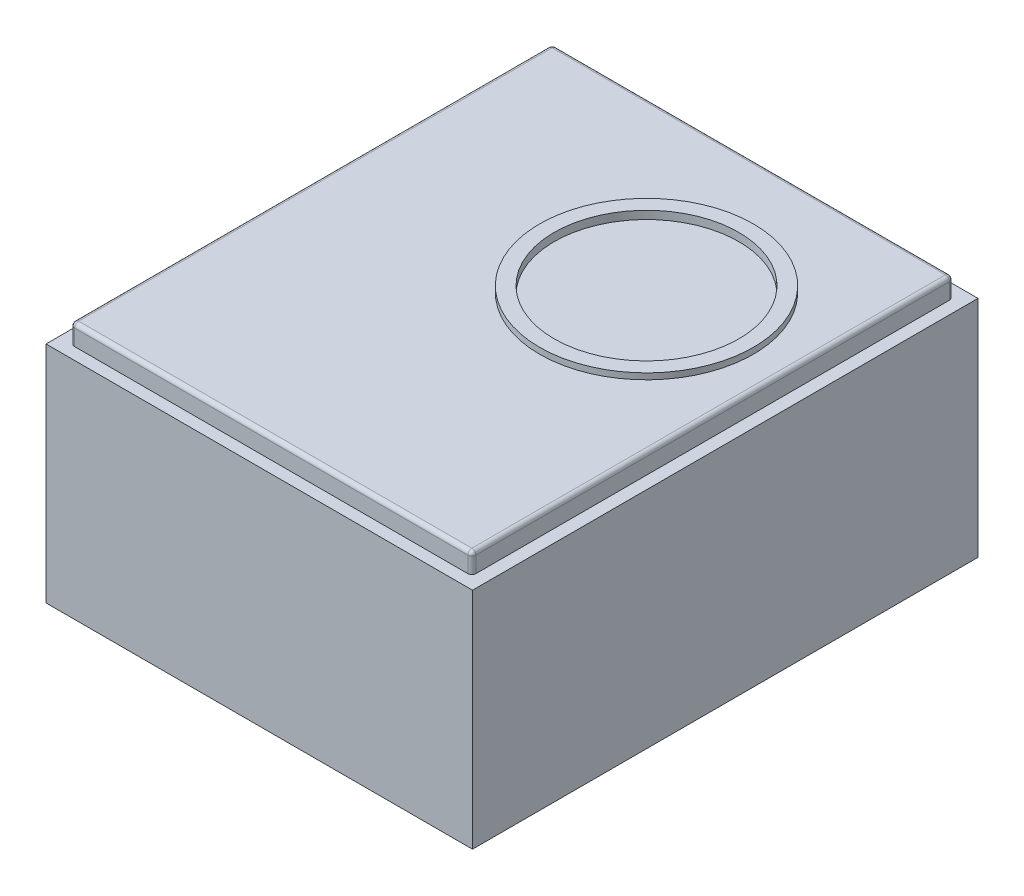
ISO-10303-21;
HEADER;
FILE_DESCRIPTION(('STEP AP214'),'2;1');
FILE_NAME('part.step','',(''),(''),'','','');
FILE_SCHEMA(('AUTOMOTIVE_DESIGN { 1 0 10303 214 1 1 1 1 }'));
ENDSEC;
DATA;
#1=APPLICATION_CONTEXT('core data for automotive mechanical design processes');
#2=APPLICATION_PROTOCOL_DEFINITION('international standard','automotive_design',2000,#1);
#3=PRODUCT_CONTEXT('',#1,'mechanical');
#4=PRODUCT('Part','Part','',(#3));
#5=PRODUCT_RELATED_PRODUCT_CATEGORY('part','',(#4));
#6=PRODUCT_DEFINITION_FORMATION('','',#4);
#7=PRODUCT_DEFINITION_CONTEXT('part definition',#1,'design');
#8=PRODUCT_DEFINITION('design','',#6,#7);
#9=PRODUCT_DEFINITION_SHAPE('','',#8);
#10=(LENGTH_UNIT() NAMED_UNIT(*) SI_UNIT(.MILLI.,.METRE.));
#11=(NAMED_UNIT(*) PLANE_ANGLE_UNIT() SI_UNIT($,.RADIAN.));
#12=(NAMED_UNIT(*) SI_UNIT($,.STERADIAN.) SOLID_ANGLE_UNIT());
#13=UNCERTAINTY_MEASURE_WITH_UNIT(LENGTH_MEASURE(1.E-05),#10,'distance_accuracy_value','');
#14=(GEOMETRIC_REPRESENTATION_CONTEXT(3) GLOBAL_UNCERTAINTY_ASSIGNED_CONTEXT((#13)) GLOBAL_UNIT_ASSIGNED_CONTEXT((#10,
#11,#12)) REPRESENTATION_CONTEXT('',''));
#15=CARTESIAN_POINT('',(0.,0.,0.));
#16=DIRECTION('',(0.,0.,1.));
#17=DIRECTION('',(1.,0.,0.));
#18=AXIS2_PLACEMENT_3D('',#15,#16,#17);
#19=CARTESIAN_POINT('',(0.,142.,0.));
#20=DIRECTION('',(0.,-1.,0.));
#21=DIRECTION('',(0.,0.,-1.));
#22=AXIS2_PLACEMENT_3D('',#19,#20,#21);
#23=PLANE('',#22);
#24=DIRECTION('',(0.,0.,-1.));
#25=VECTOR('',#24,1.);
#26=CARTESIAN_POINT('',(135.,142.,160.));
#27=LINE('',#26,#25);
#28=CARTESIAN_POINT('',(135.,142.,160.));
#29=VERTEX_POINT('',#28);
#30=CARTESIAN_POINT('',(135.,142.,-160.));
#31=VERTEX_POINT('',#30);
#32=EDGE_CURVE('E161',#29,#31,#27,.T.);
#33=ORIENTED_EDGE('',*,*,#32,.T.);
#34=DIRECTION('',(-1.,0.,0.));
#35=VECTOR('',#34,1.);
#36=CARTESIAN_POINT('',(-135.,142.,-160.));
#37=LINE('',#36,#35);
#38=CARTESIAN_POINT('',(-135.,142.,-160.));
#39=VERTEX_POINT('',#38);
#40=EDGE_CURVE('E149',#31,#39,#37,.T.);
#41=ORIENTED_EDGE('',*,*,#40,.T.);
#42=DIRECTION('',(0.,0.,1.));
#43=VECTOR('',#42,1.);
#44=CARTESIAN_POINT('',(-135.,142.,160.));
#45=LINE('',#44,#43);
#46=CARTESIAN_POINT('',(-135.,142.,160.));
#47=VERTEX_POINT('',#46);
#48=EDGE_CURVE('E160',#39,#47,#45,.T.);
#49=ORIENTED_EDGE('',*,*,#48,.T.);
#50=DIRECTION('',(1.,0.,0.));
#51=VECTOR('',#50,1.);
#52=CARTESIAN_POINT('',(-135.,142.,160.));
#53=LINE('',#52,#51);
#54=EDGE_CURVE('E166',#47,#29,#53,.T.);
#55=ORIENTED_EDGE('',*,*,#54,.T.);
#56=EDGE_LOOP('',(#33,#41,#49,#55));
#57=FACE_BOUND('',#56,.T.);
#58=DIRECTION('',(0.,0.,-1.));
#59=VECTOR('',#58,1.);
#60=CARTESIAN_POINT('',(127.,142.,-152.4));
#61=LINE('',#60,#59);
#62=CARTESIAN_POINT('',(127.,142.,149.86));
#63=VERTEX_POINT('',#62);
#64=CARTESIAN_POINT('',(127.,142.,-149.86));
#65=VERTEX_POINT('',#64);
#66=EDGE_CURVE('E285',#63,#65,#61,.T.);
#67=ORIENTED_EDGE('',*,*,#66,.F.);
#68=CARTESIAN_POINT('',(124.46,142.,149.86));
#69=DIRECTION('',(0.,-1.,0.));
#70=DIRECTION('',(0.,0.,-1.));
#71=AXIS2_PLACEMENT_3D('',#68,#69,#70);
#72=CIRCLE('',#71,2.54);
#73=CARTESIAN_POINT('',(124.46,142.,152.4));
#74=VERTEX_POINT('',#73);
#75=EDGE_CURVE('E218',#63,#74,#72,.T.);
#76=ORIENTED_EDGE('',*,*,#75,.T.);
#77=DIRECTION('',(1.,0.,0.));
#78=VECTOR('',#77,1.);
#79=CARTESIAN_POINT('',(-127.,142.,152.4));
#80=LINE('',#79,#78);
#81=CARTESIAN_POINT('',(-124.46,142.,152.4));
#82=VERTEX_POINT('',#81);
#83=EDGE_CURVE('E306',#82,#74,#80,.T.);
#84=ORIENTED_EDGE('',*,*,#83,.F.);
#85=CARTESIAN_POINT('',(-124.46,142.,149.86));
#86=DIRECTION('',(0.,-1.,0.));
#87=DIRECTION('',(0.,0.,-1.));
#88=AXIS2_PLACEMENT_3D('',#85,#86,#87);
#89=CIRCLE('',#88,2.54);
#90=CARTESIAN_POINT('',(-127.,142.,149.86));
#91=VERTEX_POINT('',#90);
#92=EDGE_CURVE('E215',#82,#91,#89,.T.);
#93=ORIENTED_EDGE('',*,*,#92,.T.);
#94=DIRECTION('',(0.,0.,1.));
#95=VECTOR('',#94,1.);
#96=CARTESIAN_POINT('',(-127.,142.,-152.4));
#97=LINE('',#96,#95);
#98=CARTESIAN_POINT('',(-127.,142.,-149.86));
#99=VERTEX_POINT('',#98);
#100=EDGE_CURVE('E297',#99,#91,#97,.T.);
#101=ORIENTED_EDGE('',*,*,#100,.F.);
#102=CARTESIAN_POINT('',(-124.46,142.,-149.86));
#103=DIRECTION('',(0.,-1.,0.));
#104=DIRECTION('',(0.,0.,-1.));
#105=AXIS2_PLACEMENT_3D('',#102,#103,#104);
#106=CIRCLE('',#105,2.54);
#107=CARTESIAN_POINT('',(-124.46,142.,-152.4));
#108=VERTEX_POINT('',#107);
#109=EDGE_CURVE('E212',#99,#108,#106,.T.);
#110=ORIENTED_EDGE('',*,*,#109,.T.);
#111=DIRECTION('',(-1.,0.,0.));
#112=VECTOR('',#111,1.);
#113=CARTESIAN_POINT('',(-127.,142.,-152.4));
#114=LINE('',#113,#112);
#115=CARTESIAN_POINT('',(124.46,142.,-152.4));
#116=VERTEX_POINT('',#115);
#117=EDGE_CURVE('E291',#116,#108,#114,.T.);
#118=ORIENTED_EDGE('',*,*,#117,.F.);
#119=CARTESIAN_POINT('',(124.46,142.,-149.86));
#120=DIRECTION('',(0.,-1.,0.));
#121=DIRECTION('',(0.,0.,-1.));
#122=AXIS2_PLACEMENT_3D('',#119,#120,#121);
#123=CIRCLE('',#122,2.54);
#124=EDGE_CURVE('E209',#116,#65,#123,.T.);
#125=ORIENTED_EDGE('',*,*,#124,.T.);
#126=EDGE_LOOP('',(#67,#76,#84,#93,#101,#110,#118,#125));
#127=FACE_BOUND('',#126,.T.);
#128=ADVANCED_FACE('F45',(#57,#127),#23,.F.);
#129=CARTESIAN_POINT('',(135.,142.,160.));
#130=DIRECTION('',(-1.,0.,0.));
#131=DIRECTION('',(0.,0.,1.));
#132=AXIS2_PLACEMENT_3D('',#129,#130,#131);
#133=PLANE('',#132);
#134=DIRECTION('',(0.,0.,-1.));
#135=VECTOR('',#134,1.);
#136=CARTESIAN_POINT('',(135.,0.,160.));
#137=LINE('',#136,#135);
#138=CARTESIAN_POINT('',(135.,0.,160.));
#139=VERTEX_POINT('',#138);
#140=CARTESIAN_POINT('',(135.,0.,-160.));
#141=VERTEX_POINT('',#140);
#142=EDGE_CURVE('E175',#139,#141,#137,.T.);
#143=ORIENTED_EDGE('',*,*,#142,.T.);
#144=DIRECTION('',(0.,-1.,0.));
#145=VECTOR('',#144,1.);
#146=CARTESIAN_POINT('',(135.,142.,-160.));
#147=LINE('',#146,#145);
#148=EDGE_CURVE('E153',#31,#141,#147,.T.);
#149=ORIENTED_EDGE('',*,*,#148,.F.);
#150=ORIENTED_EDGE('',*,*,#32,.F.);
#151=DIRECTION('',(0.,-1.,0.));
#152=VECTOR('',#151,1.);
#153=CARTESIAN_POINT('',(135.,142.,160.));
#154=LINE('',#153,#152);
#155=EDGE_CURVE('E314',#29,#139,#154,.T.);
#156=ORIENTED_EDGE('',*,*,#155,.T.);
#157=EDGE_LOOP('',(#143,#149,#150,#156));
#158=FACE_BOUND('',#157,.T.);
#159=ADVANCED_FACE('F173',(#158),#133,.F.);
#160=CARTESIAN_POINT('',(-135.,142.,-160.));
#161=DIRECTION('',(0.,0.,1.));
#162=DIRECTION('',(1.,0.,0.));
#163=AXIS2_PLACEMENT_3D('',#160,#161,#162);
#164=PLANE('',#163);
#165=DIRECTION('',(-1.,0.,0.));
#166=VECTOR('',#165,1.);
#167=CARTESIAN_POINT('',(-135.,0.,-160.));
#168=LINE('',#167,#166);
#169=CARTESIAN_POINT('',(-135.,0.,-160.));
#170=VERTEX_POINT('',#169);
#171=EDGE_CURVE('E317',#141,#170,#168,.T.);
#172=ORIENTED_EDGE('',*,*,#171,.T.);
#173=DIRECTION('',(0.,-1.,0.));
#174=VECTOR('',#173,1.);
#175=CARTESIAN_POINT('',(-135.,142.,-160.));
#176=LINE('',#175,#174);
#177=EDGE_CURVE('E156',#39,#170,#176,.T.);
#178=ORIENTED_EDGE('',*,*,#177,.F.);
#179=ORIENTED_EDGE('',*,*,#40,.F.);
#180=ORIENTED_EDGE('',*,*,#148,.T.);
#181=EDGE_LOOP('',(#172,#178,#179,#180));
#182=FACE_BOUND('',#181,.T.);
#183=ADVANCED_FACE('F151',(#182),#164,.F.);
#184=CARTESIAN_POINT('',(-135.,142.,160.));
#185=DIRECTION('',(1.,0.,0.));
#186=DIRECTION('',(0.,0.,-1.));
#187=AXIS2_PLACEMENT_3D('',#184,#185,#186);
#188=PLANE('',#187);
#189=DIRECTION('',(0.,0.,1.));
#190=VECTOR('',#189,1.);
#191=CARTESIAN_POINT('',(-135.,0.,160.));
#192=LINE('',#191,#190);
#193=CARTESIAN_POINT('',(-135.,0.,160.));
#194=VERTEX_POINT('',#193);
#195=EDGE_CURVE('E320',#170,#194,#192,.T.);
#196=ORIENTED_EDGE('',*,*,#195,.T.);
#197=DIRECTION('',(0.,-1.,0.));
#198=VECTOR('',#197,1.);
#199=CARTESIAN_POINT('',(-135.,142.,160.));
#200=LINE('',#199,#198);
#201=EDGE_CURVE('E184',#47,#194,#200,.T.);
#202=ORIENTED_EDGE('',*,*,#201,.F.);
#203=ORIENTED_EDGE('',*,*,#48,.F.);
#204=ORIENTED_EDGE('',*,*,#177,.T.);
#205=EDGE_LOOP('',(#196,#202,#203,#204));
#206=FACE_BOUND('',#205,.T.);
#207=ADVANCED_FACE('F336',(#206),#188,.F.);
#208=CARTESIAN_POINT('',(-135.,142.,160.));
#209=DIRECTION('',(0.,0.,-1.));
#210=DIRECTION('',(-1.,0.,0.));
#211=AXIS2_PLACEMENT_3D('',#208,#209,#210);
#212=PLANE('',#211);
#213=DIRECTION('',(1.,0.,0.));
#214=VECTOR('',#213,1.);
#215=CARTESIAN_POINT('',(-135.,0.,160.));
#216=LINE('',#215,#214);
#217=EDGE_CURVE('E171',#194,#139,#216,.T.);
#218=ORIENTED_EDGE('',*,*,#217,.T.);
#219=ORIENTED_EDGE('',*,*,#155,.F.);
#220=ORIENTED_EDGE('',*,*,#54,.F.);
#221=ORIENTED_EDGE('',*,*,#201,.T.);
#222=EDGE_LOOP('',(#218,#219,#220,#221));
#223=FACE_BOUND('',#222,.T.);
#224=ADVANCED_FACE('F331',(#223),#212,.F.);
#225=CARTESIAN_POINT('',(0.,0.,0.));
#226=DIRECTION('',(0.,-1.,0.));
#227=DIRECTION('',(0.,0.,-1.));
#228=AXIS2_PLACEMENT_3D('',#225,#226,#227);
#229=PLANE('',#228);
#230=ORIENTED_EDGE('',*,*,#142,.F.);
#231=ORIENTED_EDGE('',*,*,#217,.F.);
#232=ORIENTED_EDGE('',*,*,#195,.F.);
#233=ORIENTED_EDGE('',*,*,#171,.F.);
#234=EDGE_LOOP('',(#230,#231,#232,#233));
#235=FACE_BOUND('',#234,.T.);
#236=ADVANCED_FACE('F335',(#235),#229,.T.);
#237=CARTESIAN_POINT('',(127.,154.7,-152.4));
#238=DIRECTION('',(-1.,0.,0.));
#239=DIRECTION('',(0.,0.,1.));
#240=AXIS2_PLACEMENT_3D('',#237,#238,#239);
#241=PLANE('',#240);
#242=DIRECTION('',(0.,-1.,0.));
#243=VECTOR('',#242,1.);
#244=CARTESIAN_POINT('',(127.,154.7,-149.86));
#245=LINE('',#244,#243);
#246=CARTESIAN_POINT('',(127.,152.16,-149.86));
#247=VERTEX_POINT('',#246);
#248=EDGE_CURVE('E193',#65,#247,#245,.F.);
#249=ORIENTED_EDGE('',*,*,#248,.T.);
#250=DIRECTION('',(0.,0.,-1.));
#251=VECTOR('',#250,1.);
#252=CARTESIAN_POINT('',(127.,152.16,149.86));
#253=LINE('',#252,#251);
#254=CARTESIAN_POINT('',(127.,152.16,149.86));
#255=VERTEX_POINT('',#254);
#256=EDGE_CURVE('E70',#247,#255,#253,.F.);
#257=ORIENTED_EDGE('',*,*,#256,.T.);
#258=DIRECTION('',(0.,-1.,0.));
#259=VECTOR('',#258,1.);
#260=CARTESIAN_POINT('',(127.,154.7,149.86));
#261=LINE('',#260,#259);
#262=EDGE_CURVE('E190',#255,#63,#261,.T.);
#263=ORIENTED_EDGE('',*,*,#262,.T.);
#264=ORIENTED_EDGE('',*,*,#66,.T.);
#265=EDGE_LOOP('',(#249,#257,#263,#264));
#266=FACE_BOUND('',#265,.T.);
#267=ADVANCED_FACE('F353',(#266),#241,.F.);
#268=CARTESIAN_POINT('',(-127.,154.7,-152.4));
#269=DIRECTION('',(0.,0.,1.));
#270=DIRECTION('',(1.,0.,0.));
#271=AXIS2_PLACEMENT_3D('',#268,#269,#270);
#272=PLANE('',#271);
#273=DIRECTION('',(0.,-1.,0.));
#274=VECTOR('',#273,1.);
#275=CARTESIAN_POINT('',(-124.46,154.7,-152.4));
#276=LINE('',#275,#274);
#277=CARTESIAN_POINT('',(-124.46,152.16,-152.4));
#278=VERTEX_POINT('',#277);
#279=EDGE_CURVE('E177',#108,#278,#276,.F.);
#280=ORIENTED_EDGE('',*,*,#279,.T.);
#281=DIRECTION('',(-1.,0.,0.));
#282=VECTOR('',#281,1.);
#283=CARTESIAN_POINT('',(124.46,152.16,-152.4));
#284=LINE('',#283,#282);
#285=CARTESIAN_POINT('',(124.46,152.16,-152.4));
#286=VERTEX_POINT('',#285);
#287=EDGE_CURVE('E244',#278,#286,#284,.F.);
#288=ORIENTED_EDGE('',*,*,#287,.T.);
#289=DIRECTION('',(0.,-1.,0.));
#290=VECTOR('',#289,1.);
#291=CARTESIAN_POINT('',(124.46,154.7,-152.4));
#292=LINE('',#291,#290);
#293=EDGE_CURVE('E182',#286,#116,#292,.T.);
#294=ORIENTED_EDGE('',*,*,#293,.T.);
#295=ORIENTED_EDGE('',*,*,#117,.T.);
#296=EDGE_LOOP('',(#280,#288,#294,#295));
#297=FACE_BOUND('',#296,.T.);
#298=ADVANCED_FACE('F359',(#297),#272,.F.);
#299=CARTESIAN_POINT('',(-127.,154.7,-152.4));
#300=DIRECTION('',(1.,0.,0.));
#301=DIRECTION('',(0.,0.,-1.));
#302=AXIS2_PLACEMENT_3D('',#299,#300,#301);
#303=PLANE('',#302);
#304=DIRECTION('',(0.,-1.,0.));
#305=VECTOR('',#304,1.);
#306=CARTESIAN_POINT('',(-127.,154.7,149.86));
#307=LINE('',#306,#305);
#308=CARTESIAN_POINT('',(-127.,152.16,149.86));
#309=VERTEX_POINT('',#308);
#310=EDGE_CURVE('E196',#91,#309,#307,.F.);
#311=ORIENTED_EDGE('',*,*,#310,.T.);
#312=DIRECTION('',(0.,0.,1.));
#313=VECTOR('',#312,1.);
#314=CARTESIAN_POINT('',(-127.,152.16,-149.86));
#315=LINE('',#314,#313);
#316=CARTESIAN_POINT('',(-127.,152.16,-149.86));
#317=VERTEX_POINT('',#316);
#318=EDGE_CURVE('E238',#309,#317,#315,.F.);
#319=ORIENTED_EDGE('',*,*,#318,.T.);
#320=DIRECTION('',(0.,-1.,0.));
#321=VECTOR('',#320,1.);
#322=CARTESIAN_POINT('',(-127.,154.7,-149.86));
#323=LINE('',#322,#321);
#324=EDGE_CURVE('E200',#317,#99,#323,.T.);
#325=ORIENTED_EDGE('',*,*,#324,.T.);
#326=ORIENTED_EDGE('',*,*,#100,.T.);
#327=EDGE_LOOP('',(#311,#319,#325,#326));
#328=FACE_BOUND('',#327,.T.);
#329=ADVANCED_FACE('F363',(#328),#303,.F.);
#330=CARTESIAN_POINT('',(-127.,154.7,152.4));
#331=DIRECTION('',(0.,0.,-1.));
#332=DIRECTION('',(-1.,0.,0.));
#333=AXIS2_PLACEMENT_3D('',#330,#331,#332);
#334=PLANE('',#333);
#335=DIRECTION('',(0.,-1.,0.));
#336=VECTOR('',#335,1.);
#337=CARTESIAN_POINT('',(124.46,154.7,152.4));
#338=LINE('',#337,#336);
#339=CARTESIAN_POINT('',(124.46,152.16,152.4));
#340=VERTEX_POINT('',#339);
#341=EDGE_CURVE('E203',#74,#340,#338,.F.);
#342=ORIENTED_EDGE('',*,*,#341,.T.);
#343=DIRECTION('',(1.,0.,0.));
#344=VECTOR('',#343,1.);
#345=CARTESIAN_POINT('',(-124.46,152.16,152.4));
#346=LINE('',#345,#344);
#347=CARTESIAN_POINT('',(-124.46,152.16,152.4));
#348=VERTEX_POINT('',#347);
#349=EDGE_CURVE('E11',#340,#348,#346,.F.);
#350=ORIENTED_EDGE('',*,*,#349,.T.);
#351=DIRECTION('',(0.,-1.,0.));
#352=VECTOR('',#351,1.);
#353=CARTESIAN_POINT('',(-124.46,154.7,152.4));
#354=LINE('',#353,#352);
#355=EDGE_CURVE('E206',#348,#82,#354,.T.);
#356=ORIENTED_EDGE('',*,*,#355,.T.);
#357=ORIENTED_EDGE('',*,*,#83,.T.);
#358=EDGE_LOOP('',(#342,#350,#356,#357));
#359=FACE_BOUND('',#358,.T.);
#360=ADVANCED_FACE('F381',(#359),#334,.F.);
#361=CARTESIAN_POINT('',(0.,154.7,0.));
#362=DIRECTION('',(0.,1.,0.));
#363=DIRECTION('',(0.,0.,1.));
#364=AXIS2_PLACEMENT_3D('',#361,#362,#363);
#365=PLANE('',#364);
#366=CARTESIAN_POINT('',(39.5976384036771,154.7,-45.5506557578644));
#367=DIRECTION('',(0.,1.,0.));
#368=DIRECTION('',(0.,0.,1.));
#369=AXIS2_PLACEMENT_3D('',#366,#367,#368);
#370=CIRCLE('',#369,67.6785619758439);
#371=CARTESIAN_POINT('',(39.5976384036771,154.7,22.1279062179794));
#372=VERTEX_POINT('',#371);
#373=EDGE_CURVE('E300',#372,#372,#370,.T.);
#374=ORIENTED_EDGE('',*,*,#373,.F.);
#375=EDGE_LOOP('',(#374));
#376=FACE_BOUND('',#375,.T.);
#377=DIRECTION('',(-1.,0.,0.));
#378=VECTOR('',#377,1.);
#379=CARTESIAN_POINT('',(-124.46,154.7,-149.86));
#380=LINE('',#379,#378);
#381=CARTESIAN_POINT('',(124.46,154.7,-149.86));
#382=VERTEX_POINT('',#381);
#383=CARTESIAN_POINT('',(-124.46,154.7,-149.86));
#384=VERTEX_POINT('',#383);
#385=EDGE_CURVE('E231',#382,#384,#380,.T.);
#386=ORIENTED_EDGE('',*,*,#385,.T.);
#387=DIRECTION('',(0.,0.,1.));
#388=VECTOR('',#387,1.);
#389=CARTESIAN_POINT('',(-124.46,154.7,149.86));
#390=LINE('',#389,#388);
#391=CARTESIAN_POINT('',(-124.46,154.7,149.86));
#392=VERTEX_POINT('',#391);
#393=EDGE_CURVE('E234',#384,#392,#390,.T.);
#394=ORIENTED_EDGE('',*,*,#393,.T.);
#395=DIRECTION('',(1.,0.,0.));
#396=VECTOR('',#395,1.);
#397=CARTESIAN_POINT('',(124.46,154.7,149.86));
#398=LINE('',#397,#396);
#399=CARTESIAN_POINT('',(124.46,154.7,149.86));
#400=VERTEX_POINT('',#399);
#401=EDGE_CURVE('E225',#392,#400,#398,.T.);
#402=ORIENTED_EDGE('',*,*,#401,.T.);
#403=DIRECTION('',(0.,0.,-1.));
#404=VECTOR('',#403,1.);
#405=CARTESIAN_POINT('',(124.46,154.7,-149.86));
#406=LINE('',#405,#404);
#407=EDGE_CURVE('E228',#400,#382,#406,.T.);
#408=ORIENTED_EDGE('',*,*,#407,.T.);
#409=EDGE_LOOP('',(#386,#394,#402,#408));
#410=FACE_BOUND('',#409,.T.);
#411=ADVANCED_FACE('F579',(#376,#410),#365,.T.);
#412=CARTESIAN_POINT('',(124.46,154.7,-149.86));
#413=DIRECTION('',(0.,-1.,0.));
#414=DIRECTION('',(0.,0.,-1.));
#415=AXIS2_PLACEMENT_3D('',#412,#413,#414);
#416=CYLINDRICAL_SURFACE('',#415,2.54);
#417=ORIENTED_EDGE('',*,*,#293,.F.);
#418=CARTESIAN_POINT('',(124.46,152.16,-149.86));
#419=DIRECTION('',(0.,-1.,0.));
#420=DIRECTION('',(0.,0.,-1.));
#421=AXIS2_PLACEMENT_3D('',#418,#419,#420);
#422=CIRCLE('',#421,2.54);
#423=EDGE_CURVE('E247',#286,#247,#422,.T.);
#424=ORIENTED_EDGE('',*,*,#423,.T.);
#425=ORIENTED_EDGE('',*,*,#248,.F.);
#426=ORIENTED_EDGE('',*,*,#124,.F.);
#427=EDGE_LOOP('',(#417,#424,#425,#426));
#428=FACE_BOUND('',#427,.T.);
#429=ADVANCED_FACE('F409',(#428),#416,.T.);
#430=CARTESIAN_POINT('',(-124.46,154.7,-149.86));
#431=DIRECTION('',(0.,-1.,0.));
#432=DIRECTION('',(0.,0.,-1.));
#433=AXIS2_PLACEMENT_3D('',#430,#431,#432);
#434=CYLINDRICAL_SURFACE('',#433,2.54);
#435=ORIENTED_EDGE('',*,*,#324,.F.);
#436=CARTESIAN_POINT('',(-124.46,152.16,-149.86));
#437=DIRECTION('',(0.,-1.,0.));
#438=DIRECTION('',(0.,0.,-1.));
#439=AXIS2_PLACEMENT_3D('',#436,#437,#438);
#440=CIRCLE('',#439,2.54);
#441=EDGE_CURVE('E241',#317,#278,#440,.T.);
#442=ORIENTED_EDGE('',*,*,#441,.T.);
#443=ORIENTED_EDGE('',*,*,#279,.F.);
#444=ORIENTED_EDGE('',*,*,#109,.F.);
#445=EDGE_LOOP('',(#435,#442,#443,#444));
#446=FACE_BOUND('',#445,.T.);
#447=ADVANCED_FACE('F401',(#446),#434,.T.);
#448=CARTESIAN_POINT('',(-124.46,154.7,149.86));
#449=DIRECTION('',(0.,-1.,0.));
#450=DIRECTION('',(0.,0.,-1.));
#451=AXIS2_PLACEMENT_3D('',#448,#449,#450);
#452=CYLINDRICAL_SURFACE('',#451,2.54);
#453=ORIENTED_EDGE('',*,*,#355,.F.);
#454=CARTESIAN_POINT('',(-124.46,152.16,149.86));
#455=DIRECTION('',(0.,-1.,0.));
#456=DIRECTION('',(0.,0.,-1.));
#457=AXIS2_PLACEMENT_3D('',#454,#455,#456);
#458=CIRCLE('',#457,2.54);
#459=EDGE_CURVE('E221',#348,#309,#458,.T.);
#460=ORIENTED_EDGE('',*,*,#459,.T.);
#461=ORIENTED_EDGE('',*,*,#310,.F.);
#462=ORIENTED_EDGE('',*,*,#92,.F.);
#463=EDGE_LOOP('',(#453,#460,#461,#462));
#464=FACE_BOUND('',#463,.T.);
#465=ADVANCED_FACE('F385',(#464),#452,.T.);
#466=CARTESIAN_POINT('',(124.46,154.7,149.86));
#467=DIRECTION('',(0.,-1.,0.));
#468=DIRECTION('',(0.,0.,-1.));
#469=AXIS2_PLACEMENT_3D('',#466,#467,#468);
#470=CYLINDRICAL_SURFACE('',#469,2.54);
#471=ORIENTED_EDGE('',*,*,#262,.F.);
#472=CARTESIAN_POINT('',(124.46,152.16,149.86));
#473=DIRECTION('',(0.,-1.,0.));
#474=DIRECTION('',(0.,0.,-1.));
#475=AXIS2_PLACEMENT_3D('',#472,#473,#474);
#476=CIRCLE('',#475,2.54);
#477=EDGE_CURVE('E55',#255,#340,#476,.T.);
#478=ORIENTED_EDGE('',*,*,#477,.T.);
#479=ORIENTED_EDGE('',*,*,#341,.F.);
#480=ORIENTED_EDGE('',*,*,#75,.F.);
#481=EDGE_LOOP('',(#471,#478,#479,#480));
#482=FACE_BOUND('',#481,.T.);
#483=ADVANCED_FACE('F412',(#482),#470,.T.);
#484=CARTESIAN_POINT('',(124.46,152.16,-149.86));
#485=DIRECTION('',(0.,1.,0.));
#486=DIRECTION('',(0.,0.,1.));
#487=AXIS2_PLACEMENT_3D('',#484,#485,#486);
#488=SPHERICAL_SURFACE('',#487,2.54);
#489=CARTESIAN_POINT('',(124.46,152.16,-149.86));
#490=DIRECTION('',(0.,0.,1.));
#491=DIRECTION('',(1.,0.,0.));
#492=AXIS2_PLACEMENT_3D('',#489,#490,#491);
#493=CIRCLE('',#492,2.54);
#494=EDGE_CURVE('E276',#247,#382,#493,.T.);
#495=ORIENTED_EDGE('',*,*,#494,.F.);
#496=ORIENTED_EDGE('',*,*,#423,.F.);
#497=CARTESIAN_POINT('',(124.46,152.16,-149.86));
#498=DIRECTION('',(-1.,0.,0.));
#499=DIRECTION('',(0.,0.,1.));
#500=AXIS2_PLACEMENT_3D('',#497,#498,#499);
#501=CIRCLE('',#500,2.54);
#502=EDGE_CURVE('E49',#382,#286,#501,.T.);
#503=ORIENTED_EDGE('',*,*,#502,.F.);
#504=EDGE_LOOP('',(#495,#496,#503));
#505=FACE_BOUND('',#504,.T.);
#506=ADVANCED_FACE('F47',(#505),#488,.T.);
#507=CARTESIAN_POINT('',(0.,152.16,-149.86));
#508=DIRECTION('',(1.,0.,0.));
#509=DIRECTION('',(0.,0.,-1.));
#510=AXIS2_PLACEMENT_3D('',#507,#508,#509);
#511=CYLINDRICAL_SURFACE('',#510,2.54);
#512=ORIENTED_EDGE('',*,*,#502,.T.);
#513=ORIENTED_EDGE('',*,*,#287,.F.);
#514=CARTESIAN_POINT('',(-124.46,152.16,-149.86));
#515=DIRECTION('',(-1.,0.,0.));
#516=DIRECTION('',(0.,0.,1.));
#517=AXIS2_PLACEMENT_3D('',#514,#515,#516);
#518=CIRCLE('',#517,2.54);
#519=EDGE_CURVE('E273',#384,#278,#518,.T.);
#520=ORIENTED_EDGE('',*,*,#519,.F.);
#521=ORIENTED_EDGE('',*,*,#385,.F.);
#522=EDGE_LOOP('',(#512,#513,#520,#521));
#523=FACE_BOUND('',#522,.T.);
#524=ADVANCED_FACE('F407',(#523),#511,.T.);
#525=CARTESIAN_POINT('',(124.46,152.16,0.));
#526=DIRECTION('',(0.,0.,1.));
#527=DIRECTION('',(1.,0.,0.));
#528=AXIS2_PLACEMENT_3D('',#525,#526,#527);
#529=CYLINDRICAL_SURFACE('',#528,2.54);
#530=ORIENTED_EDGE('',*,*,#494,.T.);
#531=ORIENTED_EDGE('',*,*,#407,.F.);
#532=CARTESIAN_POINT('',(124.46,152.16,149.86));
#533=DIRECTION('',(0.,0.,1.));
#534=DIRECTION('',(1.,0.,0.));
#535=AXIS2_PLACEMENT_3D('',#532,#533,#534);
#536=CIRCLE('',#535,2.54);
#537=EDGE_CURVE('E269',#255,#400,#536,.T.);
#538=ORIENTED_EDGE('',*,*,#537,.F.);
#539=ORIENTED_EDGE('',*,*,#256,.F.);
#540=EDGE_LOOP('',(#530,#531,#538,#539));
#541=FACE_BOUND('',#540,.T.);
#542=ADVANCED_FACE('F370',(#541),#529,.T.);
#543=CARTESIAN_POINT('',(-124.46,152.16,-149.86));
#544=DIRECTION('',(0.,1.,0.));
#545=DIRECTION('',(0.,0.,1.));
#546=AXIS2_PLACEMENT_3D('',#543,#544,#545);
#547=SPHERICAL_SURFACE('',#546,2.54);
#548=ORIENTED_EDGE('',*,*,#519,.T.);
#549=ORIENTED_EDGE('',*,*,#441,.F.);
#550=CARTESIAN_POINT('',(-124.46,152.16,-149.86));
#551=DIRECTION('',(0.,0.,1.));
#552=DIRECTION('',(1.,0.,0.));
#553=AXIS2_PLACEMENT_3D('',#550,#551,#552);
#554=CIRCLE('',#553,2.54);
#555=EDGE_CURVE('E265',#384,#317,#554,.T.);
#556=ORIENTED_EDGE('',*,*,#555,.F.);
#557=EDGE_LOOP('',(#548,#549,#556));
#558=FACE_BOUND('',#557,.T.);
#559=ADVANCED_FACE('F405',(#558),#547,.T.);
#560=CARTESIAN_POINT('',(124.46,152.16,149.86));
#561=DIRECTION('',(0.,1.,0.));
#562=DIRECTION('',(0.,0.,1.));
#563=AXIS2_PLACEMENT_3D('',#560,#561,#562);
#564=SPHERICAL_SURFACE('',#563,2.54);
#565=ORIENTED_EDGE('',*,*,#477,.F.);
#566=ORIENTED_EDGE('',*,*,#537,.T.);
#567=CARTESIAN_POINT('',(124.46,152.16,149.86));
#568=DIRECTION('',(-1.,0.,0.));
#569=DIRECTION('',(0.,0.,1.));
#570=AXIS2_PLACEMENT_3D('',#567,#568,#569);
#571=CIRCLE('',#570,2.54);
#572=EDGE_CURVE('E261',#340,#400,#571,.T.);
#573=ORIENTED_EDGE('',*,*,#572,.F.);
#574=EDGE_LOOP('',(#565,#566,#573));
#575=FACE_BOUND('',#574,.T.);
#576=ADVANCED_FACE('F373',(#575),#564,.T.);
#577=CARTESIAN_POINT('',(-124.46,152.16,0.));
#578=DIRECTION('',(0.,0.,-1.));
#579=DIRECTION('',(-1.,0.,0.));
#580=AXIS2_PLACEMENT_3D('',#577,#578,#579);
#581=CYLINDRICAL_SURFACE('',#580,2.54);
#582=ORIENTED_EDGE('',*,*,#555,.T.);
#583=ORIENTED_EDGE('',*,*,#318,.F.);
#584=CARTESIAN_POINT('',(-124.46,152.16,149.86));
#585=DIRECTION('',(0.,0.,1.));
#586=DIRECTION('',(1.,0.,0.));
#587=AXIS2_PLACEMENT_3D('',#584,#585,#586);
#588=CIRCLE('',#587,2.54);
#589=EDGE_CURVE('E257',#392,#309,#588,.T.);
#590=ORIENTED_EDGE('',*,*,#589,.F.);
#591=ORIENTED_EDGE('',*,*,#393,.F.);
#592=EDGE_LOOP('',(#582,#583,#590,#591));
#593=FACE_BOUND('',#592,.T.);
#594=ADVANCED_FACE('F394',(#593),#581,.T.);
#595=CARTESIAN_POINT('',(0.,152.16,149.86));
#596=DIRECTION('',(-1.,0.,0.));
#597=DIRECTION('',(0.,0.,1.));
#598=AXIS2_PLACEMENT_3D('',#595,#596,#597);
#599=CYLINDRICAL_SURFACE('',#598,2.54);
#600=ORIENTED_EDGE('',*,*,#572,.T.);
#601=ORIENTED_EDGE('',*,*,#401,.F.);
#602=CARTESIAN_POINT('',(-124.46,152.16,149.86));
#603=DIRECTION('',(-1.,0.,0.));
#604=DIRECTION('',(0.,0.,1.));
#605=AXIS2_PLACEMENT_3D('',#602,#603,#604);
#606=CIRCLE('',#605,2.54);
#607=EDGE_CURVE('E254',#348,#392,#606,.T.);
#608=ORIENTED_EDGE('',*,*,#607,.F.);
#609=ORIENTED_EDGE('',*,*,#349,.F.);
#610=EDGE_LOOP('',(#600,#601,#608,#609));
#611=FACE_BOUND('',#610,.T.);
#612=ADVANCED_FACE('F378',(#611),#599,.T.);
#613=CARTESIAN_POINT('',(-124.46,152.16,149.86));
#614=DIRECTION('',(0.,1.,0.));
#615=DIRECTION('',(0.,0.,1.));
#616=AXIS2_PLACEMENT_3D('',#613,#614,#615);
#617=SPHERICAL_SURFACE('',#616,2.54);
#618=ORIENTED_EDGE('',*,*,#589,.T.);
#619=ORIENTED_EDGE('',*,*,#459,.F.);
#620=ORIENTED_EDGE('',*,*,#607,.T.);
#621=EDGE_LOOP('',(#618,#619,#620));
#622=FACE_BOUND('',#621,.T.);
#623=ADVANCED_FACE('F389',(#622),#617,.T.);
#624=CARTESIAN_POINT('',(39.5976384036771,158.51,-45.5506557578644));
#625=DIRECTION('',(0.,-1.,0.));
#626=DIRECTION('',(0.,0.,-1.));
#627=AXIS2_PLACEMENT_3D('',#624,#625,#626);
#628=CYLINDRICAL_SURFACE('',#627,67.6785619758439);
#629=CARTESIAN_POINT('',(39.5976384036771,158.51,-45.5506557578644));
#630=DIRECTION('',(0.,1.,0.));
#631=DIRECTION('',(0.,0.,1.));
#632=AXIS2_PLACEMENT_3D('',#629,#630,#631);
#633=CIRCLE('',#632,67.6785619758439);
#634=CARTESIAN_POINT('',(39.5976384036771,158.51,22.1279062179794));
#635=VERTEX_POINT('',#634);
#636=EDGE_CURVE('E258',#635,#635,#633,.T.);
#637=ORIENTED_EDGE('',*,*,#636,.F.);
#638=EDGE_LOOP('',(#637));
#639=FACE_BOUND('',#638,.T.);
#640=ORIENTED_EDGE('',*,*,#373,.T.);
#641=EDGE_LOOP('',(#640));
#642=FACE_BOUND('',#641,.T.);
#643=ADVANCED_FACE('F424',(#639,#642),#628,.T.);
#644=CARTESIAN_POINT('',(39.5976384036771,158.51,-45.5506557578644));
#645=DIRECTION('',(0.,1.,0.));
#646=DIRECTION('',(0.,0.,1.));
#647=AXIS2_PLACEMENT_3D('',#644,#645,#646);
#648=PLANE('',#647);
#649=CARTESIAN_POINT('',(39.5976384036771,158.51,-45.5506557578644));
#650=DIRECTION('',(0.,1.,0.));
#651=DIRECTION('',(0.,0.,1.));
#652=AXIS2_PLACEMENT_3D('',#649,#650,#651);
#653=CIRCLE('',#652,58.4250447146542);
#654=CARTESIAN_POINT('',(39.5976384036771,158.51,12.8743889567898));
#655=VERTEX_POINT('',#654);
#656=EDGE_CURVE('E681',#655,#655,#653,.T.);
#657=ORIENTED_EDGE('',*,*,#656,.F.);
#658=EDGE_LOOP('',(#657));
#659=FACE_BOUND('',#658,.T.);
#660=ORIENTED_EDGE('',*,*,#636,.T.);
#661=EDGE_LOOP('',(#660));
#662=FACE_BOUND('',#661,.T.);
#663=ADVANCED_FACE('F470',(#659,#662),#648,.T.);
#664=CARTESIAN_POINT('',(39.5976384036771,153.43,-45.5506557578644));
#665=DIRECTION('',(0.,1.,0.));
#666=DIRECTION('',(0.,0.,1.));
#667=AXIS2_PLACEMENT_3D('',#664,#665,#666);
#668=CYLINDRICAL_SURFACE('',#667,58.4250447146542);
#669=CARTESIAN_POINT('',(39.5976384036771,153.43,-45.5506557578644));
#670=DIRECTION('',(0.,1.,0.));
#671=DIRECTION('',(0.,0.,1.));
#672=AXIS2_PLACEMENT_3D('',#669,#670,#671);
#673=CIRCLE('',#672,58.4250447146542);
#674=CARTESIAN_POINT('',(39.5976384036771,153.43,12.8743889567898));
#675=VERTEX_POINT('',#674);
#676=EDGE_CURVE('E676',#675,#675,#673,.T.);
#677=ORIENTED_EDGE('',*,*,#676,.F.);
#678=EDGE_LOOP('',(#677));
#679=FACE_BOUND('',#678,.T.);
#680=ORIENTED_EDGE('',*,*,#656,.T.);
#681=EDGE_LOOP('',(#680));
#682=FACE_BOUND('',#681,.T.);
#683=ADVANCED_FACE('F478',(#679,#682),#668,.F.);
#684=CARTESIAN_POINT('',(39.5976384036771,153.43,-45.5506557578644));
#685=DIRECTION('',(0.,1.,0.));
#686=DIRECTION('',(0.,0.,1.));
#687=AXIS2_PLACEMENT_3D('',#684,#685,#686);
#688=PLANE('',#687);
#689=ORIENTED_EDGE('',*,*,#676,.T.);
#690=EDGE_LOOP('',(#689));
#691=FACE_BOUND('',#690,.T.);
#692=ADVANCED_FACE('F486',(#691),#688,.T.);
#693=CLOSED_SHELL('',(#128,#159,#183,#207,#224,#236,#267,#298,#329,#360,#411,#429,#447,#465,
#483,#506,#524,#542,#559,#576,#594,#612,#623,#643,#663,#683,#692));
#694=MANIFOLD_SOLID_BREP('B2',#693);
#695=ADVANCED_BREP_SHAPE_REPRESENTATION('',(#18,#694),#14);
#696=SHAPE_DEFINITION_REPRESENTATION(#9,#695);
ENDSEC;
END-ISO-10303-21;
